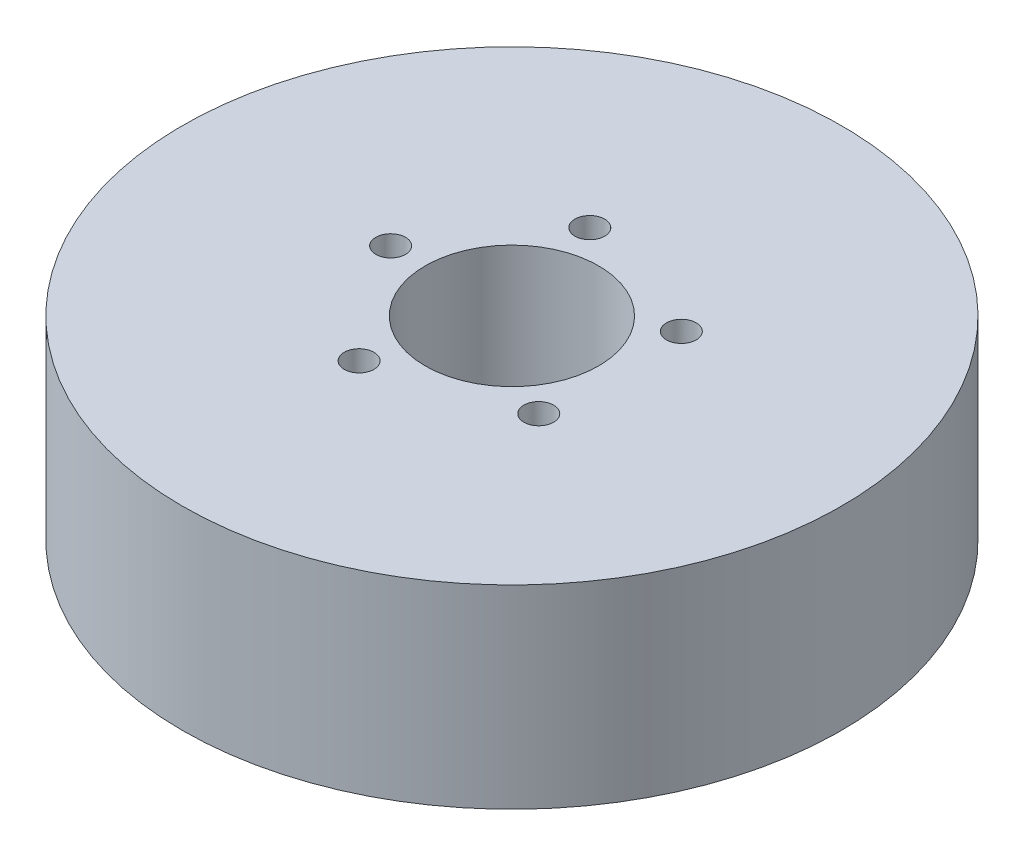
ISO-10303-21;
HEADER;
FILE_DESCRIPTION(('STEP AP214'),'2;1');
FILE_NAME('part.step','',(''),(''),'','','');
FILE_SCHEMA(('AUTOMOTIVE_DESIGN { 1 0 10303 214 1 1 1 1 }'));
ENDSEC;
DATA;
#1=APPLICATION_CONTEXT('core data for automotive mechanical design processes');
#2=APPLICATION_PROTOCOL_DEFINITION('international standard','automotive_design',2000,#1);
#3=PRODUCT_CONTEXT('',#1,'mechanical');
#4=PRODUCT('Part','Part','',(#3));
#5=PRODUCT_RELATED_PRODUCT_CATEGORY('part','',(#4));
#6=PRODUCT_DEFINITION_FORMATION('','',#4);
#7=PRODUCT_DEFINITION_CONTEXT('part definition',#1,'design');
#8=PRODUCT_DEFINITION('design','',#6,#7);
#9=PRODUCT_DEFINITION_SHAPE('','',#8);
#10=(LENGTH_UNIT() NAMED_UNIT(*) SI_UNIT(.MILLI.,.METRE.));
#11=(NAMED_UNIT(*) PLANE_ANGLE_UNIT() SI_UNIT($,.RADIAN.));
#12=(NAMED_UNIT(*) SI_UNIT($,.STERADIAN.) SOLID_ANGLE_UNIT());
#13=UNCERTAINTY_MEASURE_WITH_UNIT(LENGTH_MEASURE(1.E-05),#10,'distance_accuracy_value','');
#14=(GEOMETRIC_REPRESENTATION_CONTEXT(3) GLOBAL_UNCERTAINTY_ASSIGNED_CONTEXT((#13)) GLOBAL_UNIT_ASSIGNED_CONTEXT((#10,
#11,#12)) REPRESENTATION_CONTEXT('',''));
#15=CARTESIAN_POINT('',(0.,0.,0.));
#16=DIRECTION('',(0.,0.,1.));
#17=DIRECTION('',(1.,0.,0.));
#18=AXIS2_PLACEMENT_3D('',#15,#16,#17);
#19=CARTESIAN_POINT('',(0.,28.,0.));
#20=DIRECTION('',(0.,-1.,0.));
#21=DIRECTION('',(0.,0.,-1.));
#22=AXIS2_PLACEMENT_3D('',#19,#20,#21);
#23=CYLINDRICAL_SURFACE('',#22,47.5);
#24=CARTESIAN_POINT('',(0.,28.,0.));
#25=DIRECTION('',(0.,1.,0.));
#26=DIRECTION('',(0.,0.,1.));
#27=AXIS2_PLACEMENT_3D('',#24,#25,#26);
#28=CIRCLE('',#27,47.5);
#29=CARTESIAN_POINT('',(0.,28.,47.5));
#30=VERTEX_POINT('',#29);
#31=EDGE_CURVE('E10',#30,#30,#28,.T.);
#32=ORIENTED_EDGE('',*,*,#31,.F.);
#33=EDGE_LOOP('',(#32));
#34=FACE_BOUND('',#33,.T.);
#35=CARTESIAN_POINT('',(0.,0.,0.));
#36=DIRECTION('',(0.,1.,0.));
#37=DIRECTION('',(0.,0.,1.));
#38=AXIS2_PLACEMENT_3D('',#35,#36,#37);
#39=CIRCLE('',#38,47.5);
#40=CARTESIAN_POINT('',(0.,0.,47.5));
#41=VERTEX_POINT('',#40);
#42=EDGE_CURVE('E37',#41,#41,#39,.T.);
#43=ORIENTED_EDGE('',*,*,#42,.T.);
#44=EDGE_LOOP('',(#43));
#45=FACE_BOUND('',#44,.T.);
#46=ADVANCED_FACE('F40',(#34,#45),#23,.T.);
#47=CARTESIAN_POINT('',(0.,28.,0.));
#48=DIRECTION('',(0.,1.,0.));
#49=DIRECTION('',(0.,0.,1.));
#50=AXIS2_PLACEMENT_3D('',#47,#48,#49);
#51=PLANE('',#50);
#52=CARTESIAN_POINT('',(-5.40196007142163,28.,16.6255235802926));
#53=DIRECTION('',(0.,1.,0.));
#54=DIRECTION('',(0.951056516295155,0.,0.309016994374945));
#55=AXIS2_PLACEMENT_3D('',#52,#53,#54);
#56=CIRCLE('',#55,2.14097355210701);
#57=CARTESIAN_POINT('',(-3.36577322347467,28.,17.2871207924009));
#58=VERTEX_POINT('',#57);
#59=EDGE_CURVE('E78',#58,#58,#56,.T.);
#60=ORIENTED_EDGE('',*,*,#59,.F.);
#61=EDGE_LOOP('',(#60));
#62=FACE_BOUND('',#61,.T.);
#63=CARTESIAN_POINT('',(14.1425150728518,28.,10.2751386533836));
#64=DIRECTION('',(0.,1.,0.));
#65=DIRECTION('',(0.587785252292469,0.,-0.809016994374951));
#66=AXIS2_PLACEMENT_3D('',#63,#64,#65);
#67=CIRCLE('',#66,2.14097355210701);
#68=CARTESIAN_POINT('',(15.4009477523285,28.,8.54305466522168));
#69=VERTEX_POINT('',#68);
#70=EDGE_CURVE('E71',#69,#69,#67,.T.);
#71=ORIENTED_EDGE('',*,*,#70,.F.);
#72=EDGE_LOOP('',(#71));
#73=FACE_BOUND('',#72,.T.);
#74=CARTESIAN_POINT('',(14.1425150728517,28.,-10.2751386533838));
#75=DIRECTION('',(0.,1.,0.));
#76=DIRECTION('',(-0.58778525229248,0.,-0.809016994374942));
#77=AXIS2_PLACEMENT_3D('',#74,#75,#76);
#78=CIRCLE('',#77,2.14097355210701);
#79=CARTESIAN_POINT('',(12.8840823933749,28.,-12.0072226415456));
#80=VERTEX_POINT('',#79);
#81=EDGE_CURVE('E70',#80,#80,#78,.T.);
#82=ORIENTED_EDGE('',*,*,#81,.F.);
#83=EDGE_LOOP('',(#82));
#84=FACE_BOUND('',#83,.T.);
#85=CARTESIAN_POINT('',(-5.40196007142187,28.,-16.6255235802925));
#86=DIRECTION('',(0.,1.,0.));
#87=DIRECTION('',(-0.95105651629515,0.,0.309016994374958));
#88=AXIS2_PLACEMENT_3D('',#85,#86,#87);
#89=CIRCLE('',#88,2.14097355210701);
#90=CARTESIAN_POINT('',(-7.43814691936882,28.,-15.9639263681841));
#91=VERTEX_POINT('',#90);
#92=EDGE_CURVE('E61',#91,#91,#89,.T.);
#93=ORIENTED_EDGE('',*,*,#92,.F.);
#94=EDGE_LOOP('',(#93));
#95=FACE_BOUND('',#94,.T.);
#96=CARTESIAN_POINT('',(-17.4811100028602,28.,0.));
#97=DIRECTION('',(0.,1.,0.));
#98=DIRECTION('',(0.,0.,1.));
#99=AXIS2_PLACEMENT_3D('',#96,#97,#98);
#100=CIRCLE('',#99,2.14097355210701);
#101=CARTESIAN_POINT('',(-17.4811100028602,28.,2.14097355210701));
#102=VERTEX_POINT('',#101);
#103=EDGE_CURVE('E54',#102,#102,#100,.T.);
#104=ORIENTED_EDGE('',*,*,#103,.F.);
#105=EDGE_LOOP('',(#104));
#106=FACE_BOUND('',#105,.T.);
#107=CARTESIAN_POINT('',(0.,28.,0.));
#108=DIRECTION('',(0.,1.,0.));
#109=DIRECTION('',(0.,0.,1.));
#110=AXIS2_PLACEMENT_3D('',#107,#108,#109);
#111=CIRCLE('',#110,12.5);
#112=CARTESIAN_POINT('',(0.,28.,12.5));
#113=VERTEX_POINT('',#112);
#114=EDGE_CURVE('E50',#113,#113,#111,.T.);
#115=ORIENTED_EDGE('',*,*,#114,.F.);
#116=EDGE_LOOP('',(#115));
#117=FACE_BOUND('',#116,.T.);
#118=ORIENTED_EDGE('',*,*,#31,.T.);
#119=EDGE_LOOP('',(#118));
#120=FACE_BOUND('',#119,.T.);
#121=ADVANCED_FACE('F94',(#62,#73,#84,#95,#106,#117,#120),#51,.T.);
#122=CARTESIAN_POINT('',(0.,0.,0.));
#123=DIRECTION('',(0.,1.,0.));
#124=DIRECTION('',(0.,0.,1.));
#125=AXIS2_PLACEMENT_3D('',#122,#123,#124);
#126=PLANE('',#125);
#127=CARTESIAN_POINT('',(0.,0.,0.));
#128=DIRECTION('',(0.,1.,0.));
#129=DIRECTION('',(0.,0.,1.));
#130=AXIS2_PLACEMENT_3D('',#127,#128,#129);
#131=CIRCLE('',#130,12.5);
#132=CARTESIAN_POINT('',(0.,0.,12.5));
#133=VERTEX_POINT('',#132);
#134=EDGE_CURVE('E47',#133,#133,#131,.T.);
#135=ORIENTED_EDGE('',*,*,#134,.T.);
#136=EDGE_LOOP('',(#135));
#137=FACE_BOUND('',#136,.T.);
#138=ORIENTED_EDGE('',*,*,#42,.F.);
#139=EDGE_LOOP('',(#138));
#140=FACE_BOUND('',#139,.T.);
#141=ADVANCED_FACE('F100',(#137,#140),#126,.F.);
#142=CARTESIAN_POINT('',(0.,28.,0.));
#143=DIRECTION('',(0.,-1.,0.));
#144=DIRECTION('',(0.,0.,-1.));
#145=AXIS2_PLACEMENT_3D('',#142,#143,#144);
#146=CYLINDRICAL_SURFACE('',#145,12.5);
#147=ORIENTED_EDGE('',*,*,#114,.T.);
#148=EDGE_LOOP('',(#147));
#149=FACE_BOUND('',#148,.T.);
#150=ORIENTED_EDGE('',*,*,#134,.F.);
#151=EDGE_LOOP('',(#150));
#152=FACE_BOUND('',#151,.T.);
#153=ADVANCED_FACE('F108',(#149,#152),#146,.F.);
#154=CARTESIAN_POINT('',(-17.4811100028602,8.53190922879134,0.));
#155=DIRECTION('',(0.,1.,0.));
#156=DIRECTION('',(0.,0.,1.));
#157=AXIS2_PLACEMENT_3D('',#154,#155,#156);
#158=CYLINDRICAL_SURFACE('',#157,2.14097355210701);
#159=CARTESIAN_POINT('',(-17.4811100028602,8.53190922879134,0.));
#160=DIRECTION('',(0.,1.,0.));
#161=DIRECTION('',(0.,0.,1.));
#162=AXIS2_PLACEMENT_3D('',#159,#160,#161);
#163=CIRCLE('',#162,2.14097355210701);
#164=CARTESIAN_POINT('',(-17.4811100028602,8.53190922879134,2.14097355210701));
#165=VERTEX_POINT('',#164);
#166=EDGE_CURVE('E55',#165,#165,#163,.T.);
#167=ORIENTED_EDGE('',*,*,#166,.F.);
#168=EDGE_LOOP('',(#167));
#169=FACE_BOUND('',#168,.T.);
#170=ORIENTED_EDGE('',*,*,#103,.T.);
#171=EDGE_LOOP('',(#170));
#172=FACE_BOUND('',#171,.T.);
#173=ADVANCED_FACE('F115',(#169,#172),#158,.F.);
#174=CARTESIAN_POINT('',(-17.4811100028602,8.53190922879134,0.));
#175=DIRECTION('',(0.,1.,0.));
#176=DIRECTION('',(0.,0.,1.));
#177=AXIS2_PLACEMENT_3D('',#174,#175,#176);
#178=PLANE('',#177);
#179=ORIENTED_EDGE('',*,*,#166,.T.);
#180=EDGE_LOOP('',(#179));
#181=FACE_BOUND('',#180,.T.);
#182=ADVANCED_FACE('F142',(#181),#178,.T.);
#183=CARTESIAN_POINT('',(-5.40196007142187,8.53190922879134,-16.6255235802925));
#184=DIRECTION('',(0.,1.,0.));
#185=DIRECTION('',(0.,0.,1.));
#186=AXIS2_PLACEMENT_3D('',#183,#184,#185);
#187=CYLINDRICAL_SURFACE('',#186,2.14097355210701);
#188=CARTESIAN_POINT('',(-5.40196007142187,8.53190922879134,-16.6255235802925));
#189=DIRECTION('',(0.,1.,0.));
#190=DIRECTION('',(-0.95105651629515,0.,0.309016994374958));
#191=AXIS2_PLACEMENT_3D('',#188,#189,#190);
#192=CIRCLE('',#191,2.14097355210701);
#193=CARTESIAN_POINT('',(-7.43814691936882,8.53190922879134,-15.9639263681841));
#194=VERTEX_POINT('',#193);
#195=EDGE_CURVE('E63',#194,#194,#192,.T.);
#196=ORIENTED_EDGE('',*,*,#195,.F.);
#197=EDGE_LOOP('',(#196));
#198=FACE_BOUND('',#197,.T.);
#199=ORIENTED_EDGE('',*,*,#92,.T.);
#200=EDGE_LOOP('',(#199));
#201=FACE_BOUND('',#200,.T.);
#202=ADVANCED_FACE('F147',(#198,#201),#187,.F.);
#203=CARTESIAN_POINT('',(-5.40196007142187,8.53190922879134,-16.6255235802925));
#204=DIRECTION('',(0.,1.,0.));
#205=DIRECTION('',(-0.95105651629515,0.,0.309016994374958));
#206=AXIS2_PLACEMENT_3D('',#203,#204,#205);
#207=PLANE('',#206);
#208=ORIENTED_EDGE('',*,*,#195,.T.);
#209=EDGE_LOOP('',(#208));
#210=FACE_BOUND('',#209,.T.);
#211=ADVANCED_FACE('F163',(#210),#207,.T.);
#212=CARTESIAN_POINT('',(14.1425150728517,8.53190922879134,-10.2751386533838));
#213=DIRECTION('',(0.,1.,0.));
#214=DIRECTION('',(0.,0.,1.));
#215=AXIS2_PLACEMENT_3D('',#212,#213,#214);
#216=CYLINDRICAL_SURFACE('',#215,2.14097355210701);
#217=CARTESIAN_POINT('',(14.1425150728517,8.53190922879134,-10.2751386533838));
#218=DIRECTION('',(0.,1.,0.));
#219=DIRECTION('',(-0.58778525229248,0.,-0.809016994374942));
#220=AXIS2_PLACEMENT_3D('',#217,#218,#219);
#221=CIRCLE('',#220,2.14097355210701);
#222=CARTESIAN_POINT('',(12.8840823933749,8.53190922879134,-12.0072226415456));
#223=VERTEX_POINT('',#222);
#224=EDGE_CURVE('E69',#223,#223,#221,.T.);
#225=ORIENTED_EDGE('',*,*,#224,.F.);
#226=EDGE_LOOP('',(#225));
#227=FACE_BOUND('',#226,.T.);
#228=ORIENTED_EDGE('',*,*,#81,.T.);
#229=EDGE_LOOP('',(#228));
#230=FACE_BOUND('',#229,.T.);
#231=ADVANCED_FACE('F172',(#227,#230),#216,.F.);
#232=CARTESIAN_POINT('',(14.1425150728517,8.53190922879134,-10.2751386533838));
#233=DIRECTION('',(0.,1.,0.));
#234=DIRECTION('',(-0.58778525229248,0.,-0.809016994374942));
#235=AXIS2_PLACEMENT_3D('',#232,#233,#234);
#236=PLANE('',#235);
#237=ORIENTED_EDGE('',*,*,#224,.T.);
#238=EDGE_LOOP('',(#237));
#239=FACE_BOUND('',#238,.T.);
#240=ADVANCED_FACE('F185',(#239),#236,.T.);
#241=CARTESIAN_POINT('',(14.1425150728518,8.53190922879134,10.2751386533836));
#242=DIRECTION('',(0.,1.,0.));
#243=DIRECTION('',(0.,0.,1.));
#244=AXIS2_PLACEMENT_3D('',#241,#242,#243);
#245=CYLINDRICAL_SURFACE('',#244,2.14097355210701);
#246=CARTESIAN_POINT('',(14.1425150728518,8.53190922879134,10.2751386533836));
#247=DIRECTION('',(0.,1.,0.));
#248=DIRECTION('',(0.587785252292469,0.,-0.809016994374951));
#249=AXIS2_PLACEMENT_3D('',#246,#247,#248);
#250=CIRCLE('',#249,2.14097355210701);
#251=CARTESIAN_POINT('',(15.4009477523285,8.53190922879134,8.54305466522168));
#252=VERTEX_POINT('',#251);
#253=EDGE_CURVE('E76',#252,#252,#250,.T.);
#254=ORIENTED_EDGE('',*,*,#253,.F.);
#255=EDGE_LOOP('',(#254));
#256=FACE_BOUND('',#255,.T.);
#257=ORIENTED_EDGE('',*,*,#70,.T.);
#258=EDGE_LOOP('',(#257));
#259=FACE_BOUND('',#258,.T.);
#260=ADVANCED_FACE('F191',(#256,#259),#245,.F.);
#261=CARTESIAN_POINT('',(14.1425150728518,8.53190922879134,10.2751386533836));
#262=DIRECTION('',(0.,1.,0.));
#263=DIRECTION('',(0.587785252292469,0.,-0.809016994374951));
#264=AXIS2_PLACEMENT_3D('',#261,#262,#263);
#265=PLANE('',#264);
#266=ORIENTED_EDGE('',*,*,#253,.T.);
#267=EDGE_LOOP('',(#266));
#268=FACE_BOUND('',#267,.T.);
#269=ADVANCED_FACE('F89',(#268),#265,.T.);
#270=CARTESIAN_POINT('',(-5.40196007142163,8.53190922879134,16.6255235802926));
#271=DIRECTION('',(0.,1.,0.));
#272=DIRECTION('',(0.,0.,1.));
#273=AXIS2_PLACEMENT_3D('',#270,#271,#272);
#274=CYLINDRICAL_SURFACE('',#273,2.14097355210701);
#275=CARTESIAN_POINT('',(-5.40196007142163,8.53190922879134,16.6255235802926));
#276=DIRECTION('',(0.,1.,0.));
#277=DIRECTION('',(0.951056516295155,0.,0.309016994374945));
#278=AXIS2_PLACEMENT_3D('',#275,#276,#277);
#279=CIRCLE('',#278,2.14097355210701);
#280=CARTESIAN_POINT('',(-3.36577322347467,8.53190922879134,17.2871207924009));
#281=VERTEX_POINT('',#280);
#282=EDGE_CURVE('E59',#281,#281,#279,.T.);
#283=ORIENTED_EDGE('',*,*,#282,.F.);
#284=EDGE_LOOP('',(#283));
#285=FACE_BOUND('',#284,.T.);
#286=ORIENTED_EDGE('',*,*,#59,.T.);
#287=EDGE_LOOP('',(#286));
#288=FACE_BOUND('',#287,.T.);
#289=ADVANCED_FACE('F87',(#285,#288),#274,.F.);
#290=CARTESIAN_POINT('',(-5.40196007142163,8.53190922879134,16.6255235802926));
#291=DIRECTION('',(0.,1.,0.));
#292=DIRECTION('',(0.951056516295155,0.,0.309016994374945));
#293=AXIS2_PLACEMENT_3D('',#290,#291,#292);
#294=PLANE('',#293);
#295=ORIENTED_EDGE('',*,*,#282,.T.);
#296=EDGE_LOOP('',(#295));
#297=FACE_BOUND('',#296,.T.);
#298=ADVANCED_FACE('F84',(#297),#294,.T.);
#299=CLOSED_SHELL('',(#46,#121,#141,#153,#173,#182,#202,#211,#231,#240,#260,#269,#289,#298));
#300=MANIFOLD_SOLID_BREP('B2',#299);
#301=ADVANCED_BREP_SHAPE_REPRESENTATION('',(#18,#300),#14);
#302=SHAPE_DEFINITION_REPRESENTATION(#9,#301);
ENDSEC;
END-ISO-10303-21;
